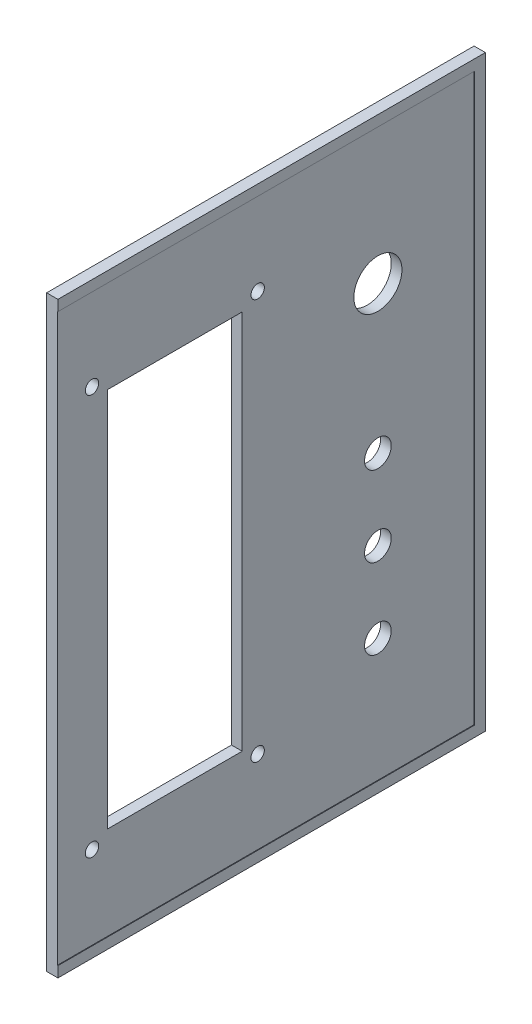
ISO-10303-21;
HEADER;
FILE_DESCRIPTION(('STEP AP214'),'2;1');
FILE_NAME('part.step','',(''),(''),'','','');
FILE_SCHEMA(('AUTOMOTIVE_DESIGN { 1 0 10303 214 1 1 1 1 }'));
ENDSEC;
DATA;
#1=APPLICATION_CONTEXT('core data for automotive mechanical design processes');
#2=APPLICATION_PROTOCOL_DEFINITION('international standard','automotive_design',2000,#1);
#3=PRODUCT_CONTEXT('',#1,'mechanical');
#4=PRODUCT('Part','Part','',(#3));
#5=PRODUCT_RELATED_PRODUCT_CATEGORY('part','',(#4));
#6=PRODUCT_DEFINITION_FORMATION('','',#4);
#7=PRODUCT_DEFINITION_CONTEXT('part definition',#1,'design');
#8=PRODUCT_DEFINITION('design','',#6,#7);
#9=PRODUCT_DEFINITION_SHAPE('','',#8);
#10=(LENGTH_UNIT() NAMED_UNIT(*) SI_UNIT(.MILLI.,.METRE.));
#11=(NAMED_UNIT(*) PLANE_ANGLE_UNIT() SI_UNIT($,.RADIAN.));
#12=(NAMED_UNIT(*) SI_UNIT($,.STERADIAN.) SOLID_ANGLE_UNIT());
#13=UNCERTAINTY_MEASURE_WITH_UNIT(LENGTH_MEASURE(1.E-05),#10,'distance_accuracy_value','');
#14=(GEOMETRIC_REPRESENTATION_CONTEXT(3) GLOBAL_UNCERTAINTY_ASSIGNED_CONTEXT((#13)) GLOBAL_UNIT_ASSIGNED_CONTEXT((#10,
#11,#12)) REPRESENTATION_CONTEXT('',''));
#15=CARTESIAN_POINT('',(0.,0.,0.));
#16=DIRECTION('',(0.,0.,1.));
#17=DIRECTION('',(1.,0.,0.));
#18=AXIS2_PLACEMENT_3D('',#15,#16,#17);
#19=CARTESIAN_POINT('',(0.,0.,80.));
#20=DIRECTION('',(-1.,0.,0.));
#21=DIRECTION('',(0.,0.,1.));
#22=AXIS2_PLACEMENT_3D('',#19,#20,#21);
#23=PLANE('',#22);
#24=CARTESIAN_POINT('',(0.,82.5,20.));
#25=DIRECTION('',(-1.,0.,0.));
#26=DIRECTION('',(0.,0.,1.));
#27=AXIS2_PLACEMENT_3D('',#24,#25,#26);
#28=CIRCLE('',#27,4.5);
#29=CARTESIAN_POINT('',(0.,82.5,24.5));
#30=VERTEX_POINT('',#29);
#31=EDGE_CURVE('E287',#30,#30,#28,.T.);
#32=ORIENTED_EDGE('',*,*,#31,.F.);
#33=EDGE_LOOP('',(#32));
#34=FACE_BOUND('',#33,.T.);
#35=CARTESIAN_POINT('',(0.,25.,20.0000000000003));
#36=DIRECTION('',(-1.,0.,0.));
#37=DIRECTION('',(0.,0.,1.));
#38=AXIS2_PLACEMENT_3D('',#35,#36,#37);
#39=CIRCLE('',#38,2.5);
#40=CARTESIAN_POINT('',(0.,25.,22.5000000000003));
#41=VERTEX_POINT('',#40);
#42=EDGE_CURVE('E295',#41,#41,#39,.T.);
#43=ORIENTED_EDGE('',*,*,#42,.F.);
#44=EDGE_LOOP('',(#43));
#45=FACE_BOUND('',#44,.T.);
#46=CARTESIAN_POINT('',(0.,40.,20.0000000000002));
#47=DIRECTION('',(-1.,0.,0.));
#48=DIRECTION('',(0.,0.,1.));
#49=AXIS2_PLACEMENT_3D('',#46,#47,#48);
#50=CIRCLE('',#49,2.5);
#51=CARTESIAN_POINT('',(0.,40.,22.5000000000002));
#52=VERTEX_POINT('',#51);
#53=EDGE_CURVE('E303',#52,#52,#50,.T.);
#54=ORIENTED_EDGE('',*,*,#53,.F.);
#55=EDGE_LOOP('',(#54));
#56=FACE_BOUND('',#55,.T.);
#57=CARTESIAN_POINT('',(0.,55.,20.));
#58=DIRECTION('',(-1.,0.,0.));
#59=DIRECTION('',(0.,0.,1.));
#60=AXIS2_PLACEMENT_3D('',#57,#58,#59);
#61=CIRCLE('',#60,2.5);
#62=CARTESIAN_POINT('',(0.,55.,22.5));
#63=VERTEX_POINT('',#62);
#64=EDGE_CURVE('E279',#63,#63,#61,.T.);
#65=ORIENTED_EDGE('',*,*,#64,.F.);
#66=EDGE_LOOP('',(#65));
#67=FACE_BOUND('',#66,.T.);
#68=CARTESIAN_POINT('',(0.,17.5,73.5));
#69=DIRECTION('',(-1.,0.,0.));
#70=DIRECTION('',(0.,0.,1.));
#71=AXIS2_PLACEMENT_3D('',#68,#69,#70);
#72=CIRCLE('',#71,1.25);
#73=CARTESIAN_POINT('',(0.,17.5,74.75));
#74=VERTEX_POINT('',#73);
#75=EDGE_CURVE('E251',#74,#74,#72,.T.);
#76=ORIENTED_EDGE('',*,*,#75,.F.);
#77=EDGE_LOOP('',(#76));
#78=FACE_BOUND('',#77,.T.);
#79=CARTESIAN_POINT('',(0.,17.5,42.5));
#80=DIRECTION('',(-1.,0.,0.));
#81=DIRECTION('',(0.,0.,1.));
#82=AXIS2_PLACEMENT_3D('',#79,#80,#81);
#83=CIRCLE('',#82,1.25);
#84=CARTESIAN_POINT('',(0.,17.5,43.75));
#85=VERTEX_POINT('',#84);
#86=EDGE_CURVE('E260',#85,#85,#83,.T.);
#87=ORIENTED_EDGE('',*,*,#86,.F.);
#88=EDGE_LOOP('',(#87));
#89=FACE_BOUND('',#88,.T.);
#90=CARTESIAN_POINT('',(0.,92.5,73.5));
#91=DIRECTION('',(-1.,0.,0.));
#92=DIRECTION('',(0.,0.,1.));
#93=AXIS2_PLACEMENT_3D('',#90,#91,#92);
#94=CIRCLE('',#93,1.25);
#95=CARTESIAN_POINT('',(0.,92.5,74.75));
#96=VERTEX_POINT('',#95);
#97=EDGE_CURVE('E268',#96,#96,#94,.T.);
#98=ORIENTED_EDGE('',*,*,#97,.F.);
#99=EDGE_LOOP('',(#98));
#100=FACE_BOUND('',#99,.T.);
#101=CARTESIAN_POINT('',(0.,92.5,42.5));
#102=DIRECTION('',(-1.,0.,0.));
#103=DIRECTION('',(0.,0.,1.));
#104=AXIS2_PLACEMENT_3D('',#101,#102,#103);
#105=CIRCLE('',#104,1.25);
#106=CARTESIAN_POINT('',(0.,92.5,43.75));
#107=VERTEX_POINT('',#106);
#108=EDGE_CURVE('E234',#107,#107,#105,.T.);
#109=ORIENTED_EDGE('',*,*,#108,.F.);
#110=EDGE_LOOP('',(#109));
#111=FACE_BOUND('',#110,.T.);
#112=DIRECTION('',(0.,1.,0.));
#113=VECTOR('',#112,1.);
#114=CARTESIAN_POINT('',(0.,0.,0.));
#115=LINE('',#114,#113);
#116=CARTESIAN_POINT('',(0.,0.,0.));
#117=VERTEX_POINT('',#116);
#118=CARTESIAN_POINT('',(0.,110.,0.));
#119=VERTEX_POINT('',#118);
#120=EDGE_CURVE('E155',#117,#119,#115,.T.);
#121=ORIENTED_EDGE('',*,*,#120,.F.);
#122=DIRECTION('',(0.,0.,-1.));
#123=VECTOR('',#122,1.);
#124=CARTESIAN_POINT('',(0.,0.,80.));
#125=LINE('',#124,#123);
#126=CARTESIAN_POINT('',(0.,0.,80.));
#127=VERTEX_POINT('',#126);
#128=EDGE_CURVE('E153',#127,#117,#125,.T.);
#129=ORIENTED_EDGE('',*,*,#128,.F.);
#130=DIRECTION('',(0.,1.,0.));
#131=VECTOR('',#130,1.);
#132=CARTESIAN_POINT('',(0.,0.,80.));
#133=LINE('',#132,#131);
#134=CARTESIAN_POINT('',(0.,110.,80.));
#135=VERTEX_POINT('',#134);
#136=EDGE_CURVE('E167',#127,#135,#133,.T.);
#137=ORIENTED_EDGE('',*,*,#136,.T.);
#138=DIRECTION('',(0.,0.,-1.));
#139=VECTOR('',#138,1.);
#140=CARTESIAN_POINT('',(0.,110.,80.));
#141=LINE('',#140,#139);
#142=EDGE_CURVE('E47',#135,#119,#141,.T.);
#143=ORIENTED_EDGE('',*,*,#142,.T.);
#144=EDGE_LOOP('',(#121,#129,#137,#143));
#145=FACE_BOUND('',#144,.T.);
#146=DIRECTION('',(0.,0.,1.));
#147=VECTOR('',#146,1.);
#148=CARTESIAN_POINT('',(0.,90.6,0.));
#149=LINE('',#148,#147);
#150=CARTESIAN_POINT('',(0.,90.6,45.4));
#151=VERTEX_POINT('',#150);
#152=CARTESIAN_POINT('',(0.,90.6,70.6));
#153=VERTEX_POINT('',#152);
#154=EDGE_CURVE('E228',#151,#153,#149,.T.);
#155=ORIENTED_EDGE('',*,*,#154,.T.);
#156=DIRECTION('',(0.,-1.,0.));
#157=VECTOR('',#156,1.);
#158=CARTESIAN_POINT('',(0.,0.,70.6));
#159=LINE('',#158,#157);
#160=CARTESIAN_POINT('',(0.,19.4,70.6));
#161=VERTEX_POINT('',#160);
#162=EDGE_CURVE('E61',#153,#161,#159,.T.);
#163=ORIENTED_EDGE('',*,*,#162,.T.);
#164=DIRECTION('',(0.,0.,1.));
#165=VECTOR('',#164,1.);
#166=CARTESIAN_POINT('',(0.,19.4,0.));
#167=LINE('',#166,#165);
#168=CARTESIAN_POINT('',(0.,19.4,45.4));
#169=VERTEX_POINT('',#168);
#170=EDGE_CURVE('E219',#169,#161,#167,.T.);
#171=ORIENTED_EDGE('',*,*,#170,.F.);
#172=DIRECTION('',(0.,-1.,0.));
#173=VECTOR('',#172,1.);
#174=CARTESIAN_POINT('',(0.,0.,45.4));
#175=LINE('',#174,#173);
#176=EDGE_CURVE('E224',#151,#169,#175,.T.);
#177=ORIENTED_EDGE('',*,*,#176,.F.);
#178=EDGE_LOOP('',(#155,#163,#171,#177));
#179=FACE_BOUND('',#178,.T.);
#180=ADVANCED_FACE('F38',(#34,#45,#56,#67,#78,#89,#100,#111,#145,#179),#23,.T.);
#181=CARTESIAN_POINT('',(2.,2.,2.));
#182=DIRECTION('',(1.,0.,0.));
#183=DIRECTION('',(0.,0.,-1.));
#184=AXIS2_PLACEMENT_3D('',#181,#182,#183);
#185=PLANE('',#184);
#186=CARTESIAN_POINT('',(2.,82.5,20.));
#187=DIRECTION('',(-1.,0.,0.));
#188=DIRECTION('',(0.,0.,1.));
#189=AXIS2_PLACEMENT_3D('',#186,#187,#188);
#190=CIRCLE('',#189,4.5);
#191=CARTESIAN_POINT('',(2.,82.5,24.5));
#192=VERTEX_POINT('',#191);
#193=EDGE_CURVE('E291',#192,#192,#190,.T.);
#194=ORIENTED_EDGE('',*,*,#193,.T.);
#195=EDGE_LOOP('',(#194));
#196=FACE_BOUND('',#195,.T.);
#197=CARTESIAN_POINT('',(2.,25.,20.0000000000003));
#198=DIRECTION('',(-1.,0.,0.));
#199=DIRECTION('',(0.,0.,1.));
#200=AXIS2_PLACEMENT_3D('',#197,#198,#199);
#201=CIRCLE('',#200,2.5);
#202=CARTESIAN_POINT('',(2.,25.,22.5000000000003));
#203=VERTEX_POINT('',#202);
#204=EDGE_CURVE('E299',#203,#203,#201,.T.);
#205=ORIENTED_EDGE('',*,*,#204,.T.);
#206=EDGE_LOOP('',(#205));
#207=FACE_BOUND('',#206,.T.);
#208=CARTESIAN_POINT('',(2.,40.,20.0000000000002));
#209=DIRECTION('',(-1.,0.,0.));
#210=DIRECTION('',(0.,0.,1.));
#211=AXIS2_PLACEMENT_3D('',#208,#209,#210);
#212=CIRCLE('',#211,2.5);
#213=CARTESIAN_POINT('',(2.,40.,22.5000000000002));
#214=VERTEX_POINT('',#213);
#215=EDGE_CURVE('E283',#214,#214,#212,.T.);
#216=ORIENTED_EDGE('',*,*,#215,.T.);
#217=EDGE_LOOP('',(#216));
#218=FACE_BOUND('',#217,.T.);
#219=CARTESIAN_POINT('',(2.,55.,20.));
#220=DIRECTION('',(-1.,0.,0.));
#221=DIRECTION('',(0.,0.,1.));
#222=AXIS2_PLACEMENT_3D('',#219,#220,#221);
#223=CIRCLE('',#222,2.5);
#224=CARTESIAN_POINT('',(2.,55.,22.5));
#225=VERTEX_POINT('',#224);
#226=EDGE_CURVE('E252',#225,#225,#223,.T.);
#227=ORIENTED_EDGE('',*,*,#226,.T.);
#228=EDGE_LOOP('',(#227));
#229=FACE_BOUND('',#228,.T.);
#230=CARTESIAN_POINT('',(2.,17.5,73.5));
#231=DIRECTION('',(-1.,0.,0.));
#232=DIRECTION('',(0.,0.,1.));
#233=AXIS2_PLACEMENT_3D('',#230,#231,#232);
#234=CIRCLE('',#233,1.25);
#235=CARTESIAN_POINT('',(2.,17.5,74.75));
#236=VERTEX_POINT('',#235);
#237=EDGE_CURVE('E247',#236,#236,#234,.T.);
#238=ORIENTED_EDGE('',*,*,#237,.T.);
#239=EDGE_LOOP('',(#238));
#240=FACE_BOUND('',#239,.T.);
#241=CARTESIAN_POINT('',(2.,17.5,42.5));
#242=DIRECTION('',(-1.,0.,0.));
#243=DIRECTION('',(0.,0.,1.));
#244=AXIS2_PLACEMENT_3D('',#241,#242,#243);
#245=CIRCLE('',#244,1.25);
#246=CARTESIAN_POINT('',(2.,17.5,43.75));
#247=VERTEX_POINT('',#246);
#248=EDGE_CURVE('E256',#247,#247,#245,.T.);
#249=ORIENTED_EDGE('',*,*,#248,.T.);
#250=EDGE_LOOP('',(#249));
#251=FACE_BOUND('',#250,.T.);
#252=CARTESIAN_POINT('',(2.,92.5,73.5));
#253=DIRECTION('',(-1.,0.,0.));
#254=DIRECTION('',(0.,0.,1.));
#255=AXIS2_PLACEMENT_3D('',#252,#253,#254);
#256=CIRCLE('',#255,1.25);
#257=CARTESIAN_POINT('',(2.,92.5,74.75));
#258=VERTEX_POINT('',#257);
#259=EDGE_CURVE('E264',#258,#258,#256,.T.);
#260=ORIENTED_EDGE('',*,*,#259,.T.);
#261=EDGE_LOOP('',(#260));
#262=FACE_BOUND('',#261,.T.);
#263=CARTESIAN_POINT('',(2.,92.5,42.5));
#264=DIRECTION('',(-1.,0.,0.));
#265=DIRECTION('',(0.,0.,1.));
#266=AXIS2_PLACEMENT_3D('',#263,#264,#265);
#267=CIRCLE('',#266,1.25);
#268=CARTESIAN_POINT('',(2.,92.5,43.75));
#269=VERTEX_POINT('',#268);
#270=EDGE_CURVE('E272',#269,#269,#267,.T.);
#271=ORIENTED_EDGE('',*,*,#270,.T.);
#272=EDGE_LOOP('',(#271));
#273=FACE_BOUND('',#272,.T.);
#274=DIRECTION('',(0.,1.,0.));
#275=VECTOR('',#274,1.);
#276=CARTESIAN_POINT('',(2.,2.,80.));
#277=LINE('',#276,#275);
#278=CARTESIAN_POINT('',(2.,2.,80.));
#279=VERTEX_POINT('',#278);
#280=CARTESIAN_POINT('',(2.,108.,80.));
#281=VERTEX_POINT('',#280);
#282=EDGE_CURVE('E191',#279,#281,#277,.T.);
#283=ORIENTED_EDGE('',*,*,#282,.F.);
#284=DIRECTION('',(0.,0.,1.));
#285=VECTOR('',#284,1.);
#286=CARTESIAN_POINT('',(2.,2.,2.));
#287=LINE('',#286,#285);
#288=CARTESIAN_POINT('',(2.,2.,2.));
#289=VERTEX_POINT('',#288);
#290=EDGE_CURVE('E161',#289,#279,#287,.T.);
#291=ORIENTED_EDGE('',*,*,#290,.F.);
#292=DIRECTION('',(0.,1.,0.));
#293=VECTOR('',#292,1.);
#294=CARTESIAN_POINT('',(2.,2.,2.));
#295=LINE('',#294,#293);
#296=CARTESIAN_POINT('',(2.,108.,2.));
#297=VERTEX_POINT('',#296);
#298=EDGE_CURVE('E201',#289,#297,#295,.T.);
#299=ORIENTED_EDGE('',*,*,#298,.T.);
#300=DIRECTION('',(0.,0.,1.));
#301=VECTOR('',#300,1.);
#302=CARTESIAN_POINT('',(2.,108.,2.));
#303=LINE('',#302,#301);
#304=EDGE_CURVE('E179',#297,#281,#303,.T.);
#305=ORIENTED_EDGE('',*,*,#304,.T.);
#306=EDGE_LOOP('',(#283,#291,#299,#305));
#307=FACE_BOUND('',#306,.T.);
#308=DIRECTION('',(0.,0.,1.));
#309=VECTOR('',#308,1.);
#310=CARTESIAN_POINT('',(2.,19.4,0.));
#311=LINE('',#310,#309);
#312=CARTESIAN_POINT('',(2.,19.4,45.4));
#313=VERTEX_POINT('',#312);
#314=CARTESIAN_POINT('',(2.,19.4,70.6));
#315=VERTEX_POINT('',#314);
#316=EDGE_CURVE('E211',#313,#315,#311,.T.);
#317=ORIENTED_EDGE('',*,*,#316,.T.);
#318=DIRECTION('',(0.,-1.,0.));
#319=VECTOR('',#318,1.);
#320=CARTESIAN_POINT('',(2.,0.,70.6));
#321=LINE('',#320,#319);
#322=CARTESIAN_POINT('',(2.,90.6,70.6));
#323=VERTEX_POINT('',#322);
#324=EDGE_CURVE('E223',#323,#315,#321,.T.);
#325=ORIENTED_EDGE('',*,*,#324,.F.);
#326=DIRECTION('',(0.,0.,1.));
#327=VECTOR('',#326,1.);
#328=CARTESIAN_POINT('',(2.,90.6,0.));
#329=LINE('',#328,#327);
#330=CARTESIAN_POINT('',(2.,90.6,45.4));
#331=VERTEX_POINT('',#330);
#332=EDGE_CURVE('E242',#331,#323,#329,.T.);
#333=ORIENTED_EDGE('',*,*,#332,.F.);
#334=DIRECTION('',(0.,-1.,0.));
#335=VECTOR('',#334,1.);
#336=CARTESIAN_POINT('',(2.,0.,45.4));
#337=LINE('',#336,#335);
#338=EDGE_CURVE('E238',#331,#313,#337,.T.);
#339=ORIENTED_EDGE('',*,*,#338,.T.);
#340=EDGE_LOOP('',(#317,#325,#333,#339));
#341=FACE_BOUND('',#340,.T.);
#342=ADVANCED_FACE('F332',(#196,#207,#218,#229,#240,#251,#262,#273,#307,#341),#185,.T.);
#343=CARTESIAN_POINT('',(0.,110.,80.));
#344=DIRECTION('',(0.,1.,0.));
#345=DIRECTION('',(0.,0.,1.));
#346=AXIS2_PLACEMENT_3D('',#343,#344,#345);
#347=PLANE('',#346);
#348=DIRECTION('',(0.,0.,1.));
#349=VECTOR('',#348,1.);
#350=CARTESIAN_POINT('',(2.1148164595432,110.,0.));
#351=LINE('',#350,#349);
#352=CARTESIAN_POINT('',(2.1148164595432,110.,0.));
#353=VERTEX_POINT('',#352);
#354=CARTESIAN_POINT('',(2.1148164595432,110.,80.));
#355=VERTEX_POINT('',#354);
#356=EDGE_CURVE('E138',#353,#355,#351,.T.);
#357=ORIENTED_EDGE('',*,*,#356,.F.);
#358=DIRECTION('',(1.,0.,0.));
#359=VECTOR('',#358,1.);
#360=CARTESIAN_POINT('',(0.,110.,0.));
#361=LINE('',#360,#359);
#362=EDGE_CURVE('E148',#119,#353,#361,.T.);
#363=ORIENTED_EDGE('',*,*,#362,.F.);
#364=ORIENTED_EDGE('',*,*,#142,.F.);
#365=DIRECTION('',(1.,0.,0.));
#366=VECTOR('',#365,1.);
#367=CARTESIAN_POINT('',(0.,110.,80.));
#368=LINE('',#367,#366);
#369=EDGE_CURVE('E159',#135,#355,#368,.T.);
#370=ORIENTED_EDGE('',*,*,#369,.T.);
#371=EDGE_LOOP('',(#357,#363,#364,#370));
#372=FACE_BOUND('',#371,.T.);
#373=ADVANCED_FACE('F40',(#372),#347,.T.);
#374=CARTESIAN_POINT('',(0.,0.,80.));
#375=DIRECTION('',(0.,1.,0.));
#376=DIRECTION('',(0.,0.,1.));
#377=AXIS2_PLACEMENT_3D('',#374,#375,#376);
#378=PLANE('',#377);
#379=DIRECTION('',(1.,0.,0.));
#380=VECTOR('',#379,1.);
#381=CARTESIAN_POINT('',(0.,0.,0.));
#382=LINE('',#381,#380);
#383=CARTESIAN_POINT('',(2.1148164595432,0.,0.));
#384=VERTEX_POINT('',#383);
#385=EDGE_CURVE('E145',#117,#384,#382,.T.);
#386=ORIENTED_EDGE('',*,*,#385,.T.);
#387=DIRECTION('',(0.,0.,1.));
#388=VECTOR('',#387,1.);
#389=CARTESIAN_POINT('',(2.1148164595432,0.,0.));
#390=LINE('',#389,#388);
#391=CARTESIAN_POINT('',(2.1148164595432,0.,80.));
#392=VERTEX_POINT('',#391);
#393=EDGE_CURVE('E126',#384,#392,#390,.T.);
#394=ORIENTED_EDGE('',*,*,#393,.T.);
#395=DIRECTION('',(1.,0.,0.));
#396=VECTOR('',#395,1.);
#397=CARTESIAN_POINT('',(0.,0.,80.));
#398=LINE('',#397,#396);
#399=EDGE_CURVE('E170',#127,#392,#398,.T.);
#400=ORIENTED_EDGE('',*,*,#399,.F.);
#401=ORIENTED_EDGE('',*,*,#128,.T.);
#402=EDGE_LOOP('',(#386,#394,#400,#401));
#403=FACE_BOUND('',#402,.T.);
#404=ADVANCED_FACE('F152',(#403),#378,.F.);
#405=CARTESIAN_POINT('',(0.,0.,80.));
#406=DIRECTION('',(0.,0.,1.));
#407=DIRECTION('',(1.,0.,0.));
#408=AXIS2_PLACEMENT_3D('',#405,#406,#407);
#409=PLANE('',#408);
#410=DIRECTION('',(0.,-1.,0.));
#411=VECTOR('',#410,1.);
#412=CARTESIAN_POINT('',(2.1148164595432,110.,80.));
#413=LINE('',#412,#411);
#414=CARTESIAN_POINT('',(2.1148164595432,108.,80.));
#415=VERTEX_POINT('',#414);
#416=EDGE_CURVE('E150',#355,#415,#413,.T.);
#417=ORIENTED_EDGE('',*,*,#416,.F.);
#418=ORIENTED_EDGE('',*,*,#369,.F.);
#419=ORIENTED_EDGE('',*,*,#136,.F.);
#420=ORIENTED_EDGE('',*,*,#399,.T.);
#421=CARTESIAN_POINT('',(2.1148164595432,2.,80.));
#422=VERTEX_POINT('',#421);
#423=EDGE_CURVE('E132',#422,#392,#413,.T.);
#424=ORIENTED_EDGE('',*,*,#423,.F.);
#425=DIRECTION('',(-1.,0.,0.));
#426=VECTOR('',#425,1.);
#427=CARTESIAN_POINT('',(153.,2.,80.));
#428=LINE('',#427,#426);
#429=EDGE_CURVE('E187',#422,#279,#428,.T.);
#430=ORIENTED_EDGE('',*,*,#429,.T.);
#431=ORIENTED_EDGE('',*,*,#282,.T.);
#432=DIRECTION('',(-1.,0.,0.));
#433=VECTOR('',#432,1.);
#434=CARTESIAN_POINT('',(153.,108.,80.));
#435=LINE('',#434,#433);
#436=EDGE_CURVE('E195',#415,#281,#435,.T.);
#437=ORIENTED_EDGE('',*,*,#436,.F.);
#438=EDGE_LOOP('',(#417,#418,#419,#420,#424,#430,#431,#437));
#439=FACE_BOUND('',#438,.T.);
#440=ADVANCED_FACE('F327',(#439),#409,.T.);
#441=CARTESIAN_POINT('',(0.,0.,0.));
#442=DIRECTION('',(0.,0.,1.));
#443=DIRECTION('',(1.,0.,0.));
#444=AXIS2_PLACEMENT_3D('',#441,#442,#443);
#445=PLANE('',#444);
#446=ORIENTED_EDGE('',*,*,#362,.T.);
#447=DIRECTION('',(0.,-1.,0.));
#448=VECTOR('',#447,1.);
#449=CARTESIAN_POINT('',(2.1148164595432,110.,0.));
#450=LINE('',#449,#448);
#451=EDGE_CURVE('E129',#353,#384,#450,.T.);
#452=ORIENTED_EDGE('',*,*,#451,.T.);
#453=ORIENTED_EDGE('',*,*,#385,.F.);
#454=ORIENTED_EDGE('',*,*,#120,.T.);
#455=EDGE_LOOP('',(#446,#452,#453,#454));
#456=FACE_BOUND('',#455,.T.);
#457=ADVANCED_FACE('F143',(#456),#445,.F.);
#458=CARTESIAN_POINT('',(153.,108.,2.));
#459=DIRECTION('',(0.,1.,0.));
#460=DIRECTION('',(0.,0.,1.));
#461=AXIS2_PLACEMENT_3D('',#458,#459,#460);
#462=PLANE('',#461);
#463=DIRECTION('',(-1.,0.,0.));
#464=VECTOR('',#463,1.);
#465=CARTESIAN_POINT('',(153.,108.,2.));
#466=LINE('',#465,#464);
#467=CARTESIAN_POINT('',(2.1148164595432,108.,2.));
#468=VERTEX_POINT('',#467);
#469=EDGE_CURVE('E190',#468,#297,#466,.T.);
#470=ORIENTED_EDGE('',*,*,#469,.F.);
#471=DIRECTION('',(0.,0.,1.));
#472=VECTOR('',#471,1.);
#473=CARTESIAN_POINT('',(2.1148164595432,108.,2.));
#474=LINE('',#473,#472);
#475=EDGE_CURVE('E54',#468,#415,#474,.T.);
#476=ORIENTED_EDGE('',*,*,#475,.T.);
#477=ORIENTED_EDGE('',*,*,#436,.T.);
#478=ORIENTED_EDGE('',*,*,#304,.F.);
#479=EDGE_LOOP('',(#470,#476,#477,#478));
#480=FACE_BOUND('',#479,.T.);
#481=ADVANCED_FACE('F325',(#480),#462,.F.);
#482=CARTESIAN_POINT('',(153.,2.,2.));
#483=DIRECTION('',(0.,1.,0.));
#484=DIRECTION('',(0.,0.,1.));
#485=AXIS2_PLACEMENT_3D('',#482,#483,#484);
#486=PLANE('',#485);
#487=DIRECTION('',(0.,0.,1.));
#488=VECTOR('',#487,1.);
#489=CARTESIAN_POINT('',(2.1148164595432,2.,2.));
#490=LINE('',#489,#488);
#491=CARTESIAN_POINT('',(2.1148164595432,2.,2.));
#492=VERTEX_POINT('',#491);
#493=EDGE_CURVE('E312',#492,#422,#490,.T.);
#494=ORIENTED_EDGE('',*,*,#493,.F.);
#495=DIRECTION('',(-1.,0.,0.));
#496=VECTOR('',#495,1.);
#497=CARTESIAN_POINT('',(153.,2.,2.));
#498=LINE('',#497,#496);
#499=EDGE_CURVE('E183',#492,#289,#498,.T.);
#500=ORIENTED_EDGE('',*,*,#499,.T.);
#501=ORIENTED_EDGE('',*,*,#290,.T.);
#502=ORIENTED_EDGE('',*,*,#429,.F.);
#503=EDGE_LOOP('',(#494,#500,#501,#502));
#504=FACE_BOUND('',#503,.T.);
#505=ADVANCED_FACE('F340',(#504),#486,.T.);
#506=CARTESIAN_POINT('',(0.,0.,2.));
#507=DIRECTION('',(0.,0.,-1.));
#508=DIRECTION('',(-1.,0.,0.));
#509=AXIS2_PLACEMENT_3D('',#506,#507,#508);
#510=PLANE('',#509);
#511=ORIENTED_EDGE('',*,*,#499,.F.);
#512=DIRECTION('',(0.,1.,0.));
#513=VECTOR('',#512,1.);
#514=CARTESIAN_POINT('',(2.1148164595432,0.,2.));
#515=LINE('',#514,#513);
#516=EDGE_CURVE('E11',#492,#468,#515,.T.);
#517=ORIENTED_EDGE('',*,*,#516,.T.);
#518=ORIENTED_EDGE('',*,*,#469,.T.);
#519=ORIENTED_EDGE('',*,*,#298,.F.);
#520=EDGE_LOOP('',(#511,#517,#518,#519));
#521=FACE_BOUND('',#520,.T.);
#522=ADVANCED_FACE('F337',(#521),#510,.F.);
#523=CARTESIAN_POINT('',(2.,0.,70.6));
#524=DIRECTION('',(0.,0.,-1.));
#525=DIRECTION('',(-1.,0.,0.));
#526=AXIS2_PLACEMENT_3D('',#523,#524,#525);
#527=PLANE('',#526);
#528=ORIENTED_EDGE('',*,*,#162,.F.);
#529=DIRECTION('',(-1.,0.,0.));
#530=VECTOR('',#529,1.);
#531=CARTESIAN_POINT('',(2.,90.6,70.6));
#532=LINE('',#531,#530);
#533=EDGE_CURVE('E207',#323,#153,#532,.T.);
#534=ORIENTED_EDGE('',*,*,#533,.F.);
#535=ORIENTED_EDGE('',*,*,#324,.T.);
#536=DIRECTION('',(-1.,0.,0.));
#537=VECTOR('',#536,1.);
#538=CARTESIAN_POINT('',(2.,19.4,70.6));
#539=LINE('',#538,#537);
#540=EDGE_CURVE('E198',#315,#161,#539,.T.);
#541=ORIENTED_EDGE('',*,*,#540,.T.);
#542=EDGE_LOOP('',(#528,#534,#535,#541));
#543=FACE_BOUND('',#542,.T.);
#544=ADVANCED_FACE('F347',(#543),#527,.T.);
#545=CARTESIAN_POINT('',(2.,19.4,0.));
#546=DIRECTION('',(0.,-1.,0.));
#547=DIRECTION('',(0.,0.,-1.));
#548=AXIS2_PLACEMENT_3D('',#545,#546,#547);
#549=PLANE('',#548);
#550=ORIENTED_EDGE('',*,*,#170,.T.);
#551=ORIENTED_EDGE('',*,*,#540,.F.);
#552=ORIENTED_EDGE('',*,*,#316,.F.);
#553=DIRECTION('',(-1.,0.,0.));
#554=VECTOR('',#553,1.);
#555=CARTESIAN_POINT('',(2.,19.4,45.4));
#556=LINE('',#555,#554);
#557=EDGE_CURVE('E214',#313,#169,#556,.T.);
#558=ORIENTED_EDGE('',*,*,#557,.T.);
#559=EDGE_LOOP('',(#550,#551,#552,#558));
#560=FACE_BOUND('',#559,.T.);
#561=ADVANCED_FACE('F383',(#560),#549,.F.);
#562=CARTESIAN_POINT('',(2.,0.,45.4));
#563=DIRECTION('',(0.,0.,-1.));
#564=DIRECTION('',(-1.,0.,0.));
#565=AXIS2_PLACEMENT_3D('',#562,#563,#564);
#566=PLANE('',#565);
#567=ORIENTED_EDGE('',*,*,#176,.T.);
#568=ORIENTED_EDGE('',*,*,#557,.F.);
#569=ORIENTED_EDGE('',*,*,#338,.F.);
#570=DIRECTION('',(-1.,0.,0.));
#571=VECTOR('',#570,1.);
#572=CARTESIAN_POINT('',(2.,90.6,45.4));
#573=LINE('',#572,#571);
#574=EDGE_CURVE('E210',#331,#151,#573,.T.);
#575=ORIENTED_EDGE('',*,*,#574,.T.);
#576=EDGE_LOOP('',(#567,#568,#569,#575));
#577=FACE_BOUND('',#576,.T.);
#578=ADVANCED_FACE('F385',(#577),#566,.F.);
#579=CARTESIAN_POINT('',(2.,90.6,0.));
#580=DIRECTION('',(0.,-1.,0.));
#581=DIRECTION('',(0.,0.,-1.));
#582=AXIS2_PLACEMENT_3D('',#579,#580,#581);
#583=PLANE('',#582);
#584=ORIENTED_EDGE('',*,*,#154,.F.);
#585=ORIENTED_EDGE('',*,*,#574,.F.);
#586=ORIENTED_EDGE('',*,*,#332,.T.);
#587=ORIENTED_EDGE('',*,*,#533,.T.);
#588=EDGE_LOOP('',(#584,#585,#586,#587));
#589=FACE_BOUND('',#588,.T.);
#590=ADVANCED_FACE('F377',(#589),#583,.T.);
#591=CARTESIAN_POINT('',(2.,92.5,42.5));
#592=DIRECTION('',(-1.,0.,0.));
#593=DIRECTION('',(0.,0.,1.));
#594=AXIS2_PLACEMENT_3D('',#591,#592,#593);
#595=CYLINDRICAL_SURFACE('',#594,1.25);
#596=ORIENTED_EDGE('',*,*,#270,.F.);
#597=EDGE_LOOP('',(#596));
#598=FACE_BOUND('',#597,.T.);
#599=ORIENTED_EDGE('',*,*,#108,.T.);
#600=EDGE_LOOP('',(#599));
#601=FACE_BOUND('',#600,.T.);
#602=ADVANCED_FACE('F392',(#598,#601),#595,.F.);
#603=CARTESIAN_POINT('',(2.,92.5,73.5));
#604=DIRECTION('',(-1.,0.,0.));
#605=DIRECTION('',(0.,0.,1.));
#606=AXIS2_PLACEMENT_3D('',#603,#604,#605);
#607=CYLINDRICAL_SURFACE('',#606,1.25);
#608=ORIENTED_EDGE('',*,*,#259,.F.);
#609=EDGE_LOOP('',(#608));
#610=FACE_BOUND('',#609,.T.);
#611=ORIENTED_EDGE('',*,*,#97,.T.);
#612=EDGE_LOOP('',(#611));
#613=FACE_BOUND('',#612,.T.);
#614=ADVANCED_FACE('F426',(#610,#613),#607,.F.);
#615=CARTESIAN_POINT('',(2.,17.5,42.5));
#616=DIRECTION('',(-1.,0.,0.));
#617=DIRECTION('',(0.,0.,1.));
#618=AXIS2_PLACEMENT_3D('',#615,#616,#617);
#619=CYLINDRICAL_SURFACE('',#618,1.25);
#620=ORIENTED_EDGE('',*,*,#248,.F.);
#621=EDGE_LOOP('',(#620));
#622=FACE_BOUND('',#621,.T.);
#623=ORIENTED_EDGE('',*,*,#86,.T.);
#624=EDGE_LOOP('',(#623));
#625=FACE_BOUND('',#624,.T.);
#626=ADVANCED_FACE('F436',(#622,#625),#619,.F.);
#627=CARTESIAN_POINT('',(2.,17.5,73.5));
#628=DIRECTION('',(-1.,0.,0.));
#629=DIRECTION('',(0.,0.,1.));
#630=AXIS2_PLACEMENT_3D('',#627,#628,#629);
#631=CYLINDRICAL_SURFACE('',#630,1.25);
#632=ORIENTED_EDGE('',*,*,#237,.F.);
#633=EDGE_LOOP('',(#632));
#634=FACE_BOUND('',#633,.T.);
#635=ORIENTED_EDGE('',*,*,#75,.T.);
#636=EDGE_LOOP('',(#635));
#637=FACE_BOUND('',#636,.T.);
#638=ADVANCED_FACE('F446',(#634,#637),#631,.F.);
#639=CARTESIAN_POINT('',(2.,55.,20.));
#640=DIRECTION('',(-1.,0.,0.));
#641=DIRECTION('',(0.,0.,1.));
#642=AXIS2_PLACEMENT_3D('',#639,#640,#641);
#643=CYLINDRICAL_SURFACE('',#642,2.5);
#644=ORIENTED_EDGE('',*,*,#226,.F.);
#645=EDGE_LOOP('',(#644));
#646=FACE_BOUND('',#645,.T.);
#647=ORIENTED_EDGE('',*,*,#64,.T.);
#648=EDGE_LOOP('',(#647));
#649=FACE_BOUND('',#648,.T.);
#650=ADVANCED_FACE('F455',(#646,#649),#643,.F.);
#651=CARTESIAN_POINT('',(2.,40.,20.0000000000002));
#652=DIRECTION('',(-1.,0.,0.));
#653=DIRECTION('',(0.,0.,1.));
#654=AXIS2_PLACEMENT_3D('',#651,#652,#653);
#655=CYLINDRICAL_SURFACE('',#654,2.5);
#656=ORIENTED_EDGE('',*,*,#215,.F.);
#657=EDGE_LOOP('',(#656));
#658=FACE_BOUND('',#657,.T.);
#659=ORIENTED_EDGE('',*,*,#53,.T.);
#660=EDGE_LOOP('',(#659));
#661=FACE_BOUND('',#660,.T.);
#662=ADVANCED_FACE('F475',(#658,#661),#655,.F.);
#663=CARTESIAN_POINT('',(2.,25.,20.0000000000003));
#664=DIRECTION('',(-1.,0.,0.));
#665=DIRECTION('',(0.,0.,1.));
#666=AXIS2_PLACEMENT_3D('',#663,#664,#665);
#667=CYLINDRICAL_SURFACE('',#666,2.5);
#668=ORIENTED_EDGE('',*,*,#204,.F.);
#669=EDGE_LOOP('',(#668));
#670=FACE_BOUND('',#669,.T.);
#671=ORIENTED_EDGE('',*,*,#42,.T.);
#672=EDGE_LOOP('',(#671));
#673=FACE_BOUND('',#672,.T.);
#674=ADVANCED_FACE('F485',(#670,#673),#667,.F.);
#675=CARTESIAN_POINT('',(2.,82.5,20.));
#676=DIRECTION('',(-1.,0.,0.));
#677=DIRECTION('',(0.,0.,1.));
#678=AXIS2_PLACEMENT_3D('',#675,#676,#677);
#679=CYLINDRICAL_SURFACE('',#678,4.5);
#680=ORIENTED_EDGE('',*,*,#193,.F.);
#681=EDGE_LOOP('',(#680));
#682=FACE_BOUND('',#681,.T.);
#683=ORIENTED_EDGE('',*,*,#31,.T.);
#684=EDGE_LOOP('',(#683));
#685=FACE_BOUND('',#684,.T.);
#686=ADVANCED_FACE('F494',(#682,#685),#679,.F.);
#687=CARTESIAN_POINT('',(2.1148164595432,110.,0.));
#688=DIRECTION('',(-1.,0.,0.));
#689=DIRECTION('',(0.,0.,1.));
#690=AXIS2_PLACEMENT_3D('',#687,#688,#689);
#691=PLANE('',#690);
#692=ORIENTED_EDGE('',*,*,#516,.F.);
#693=ORIENTED_EDGE('',*,*,#493,.T.);
#694=ORIENTED_EDGE('',*,*,#423,.T.);
#695=ORIENTED_EDGE('',*,*,#393,.F.);
#696=ORIENTED_EDGE('',*,*,#451,.F.);
#697=ORIENTED_EDGE('',*,*,#356,.T.);
#698=ORIENTED_EDGE('',*,*,#416,.T.);
#699=ORIENTED_EDGE('',*,*,#475,.F.);
#700=EDGE_LOOP('',(#692,#693,#694,#695,#696,#697,#698,#699));
#701=FACE_BOUND('',#700,.T.);
#702=ADVANCED_FACE('F128',(#701),#691,.F.);
#703=CLOSED_SHELL('',(#180,#342,#373,#404,#440,#457,#481,#505,#522,#544,#561,#578,#590,#602,
#614,#626,#638,#650,#662,#674,#686,#702));
#704=MANIFOLD_SOLID_BREP('B2',#703);
#705=ADVANCED_BREP_SHAPE_REPRESENTATION('',(#18,#704),#14);
#706=SHAPE_DEFINITION_REPRESENTATION(#9,#705);
ENDSEC;
END-ISO-10303-21;
